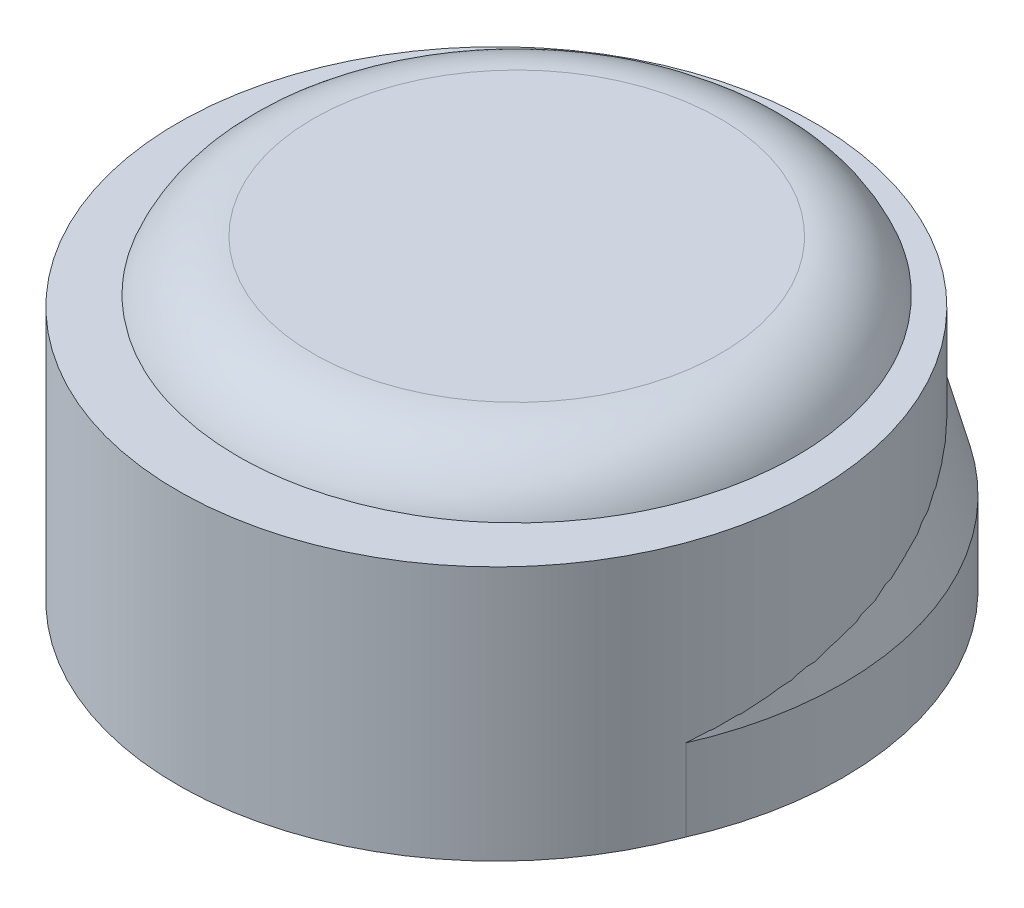
ISO-10303-21;
HEADER;
FILE_DESCRIPTION(('STEP AP214'),'2;1');
FILE_NAME('part.step','',(''),(''),'','','');
FILE_SCHEMA(('AUTOMOTIVE_DESIGN { 1 0 10303 214 1 1 1 1 }'));
ENDSEC;
DATA;
#1=APPLICATION_CONTEXT('core data for automotive mechanical design processes');
#2=APPLICATION_PROTOCOL_DEFINITION('international standard','automotive_design',2000,#1);
#3=PRODUCT_CONTEXT('',#1,'mechanical');
#4=PRODUCT('Part','Part','',(#3));
#5=PRODUCT_RELATED_PRODUCT_CATEGORY('part','',(#4));
#6=PRODUCT_DEFINITION_FORMATION('','',#4);
#7=PRODUCT_DEFINITION_CONTEXT('part definition',#1,'design');
#8=PRODUCT_DEFINITION('design','',#6,#7);
#9=PRODUCT_DEFINITION_SHAPE('','',#8);
#10=(LENGTH_UNIT() NAMED_UNIT(*) SI_UNIT(.MILLI.,.METRE.));
#11=(NAMED_UNIT(*) PLANE_ANGLE_UNIT() SI_UNIT($,.RADIAN.));
#12=(NAMED_UNIT(*) SI_UNIT($,.STERADIAN.) SOLID_ANGLE_UNIT());
#13=UNCERTAINTY_MEASURE_WITH_UNIT(LENGTH_MEASURE(1.E-05),#10,'distance_accuracy_value','');
#14=(GEOMETRIC_REPRESENTATION_CONTEXT(3) GLOBAL_UNCERTAINTY_ASSIGNED_CONTEXT((#13)) GLOBAL_UNIT_ASSIGNED_CONTEXT((#10,
#11,#12)) REPRESENTATION_CONTEXT('',''));
#15=CARTESIAN_POINT('',(0.,0.,0.));
#16=DIRECTION('',(0.,0.,1.));
#17=DIRECTION('',(1.,0.,0.));
#18=AXIS2_PLACEMENT_3D('',#15,#16,#17);
#19=CARTESIAN_POINT('',(0.,6.35,0.508));
#20=DIRECTION('',(0.,-1.,0.));
#21=DIRECTION('',(1.,0.,0.));
#22=AXIS2_PLACEMENT_3D('',#19,#20,#21);
#23=CYLINDRICAL_SURFACE('',#22,7.9375);
#24=CARTESIAN_POINT('',(0.,6.35,0.508));
#25=DIRECTION('',(0.,-1.,0.));
#26=DIRECTION('',(1.,0.,0.));
#27=AXIS2_PLACEMENT_3D('',#24,#25,#26);
#28=CIRCLE('',#27,7.9375);
#29=CARTESIAN_POINT('',(7.9375,6.35,0.508));
#30=VERTEX_POINT('',#29);
#31=EDGE_CURVE('E11',#30,#30,#28,.T.);
#32=ORIENTED_EDGE('',*,*,#31,.T.);
#33=EDGE_LOOP('',(#32));
#34=FACE_BOUND('',#33,.T.);
#35=CARTESIAN_POINT('',(0.,0.,0.508));
#36=DIRECTION('',(0.,-1.,0.));
#37=DIRECTION('',(1.,0.,0.));
#38=AXIS2_PLACEMENT_3D('',#35,#36,#37);
#39=CIRCLE('',#38,7.9375);
#40=CARTESIAN_POINT('',(7.9375,0.,0.508));
#41=VERTEX_POINT('',#40);
#42=EDGE_CURVE('E44',#41,#41,#39,.T.);
#43=ORIENTED_EDGE('',*,*,#42,.F.);
#44=EDGE_LOOP('',(#43));
#45=FACE_BOUND('',#44,.T.);
#46=ADVANCED_FACE('F41',(#34,#45),#23,.T.);
#47=CARTESIAN_POINT('',(0.,6.35,0.508));
#48=DIRECTION('',(0.,-1.,0.));
#49=DIRECTION('',(1.,0.,0.));
#50=AXIS2_PLACEMENT_3D('',#47,#48,#49);
#51=PLANE('',#50);
#52=ORIENTED_EDGE('',*,*,#31,.F.);
#53=EDGE_LOOP('',(#52));
#54=FACE_BOUND('',#53,.T.);
#55=ADVANCED_FACE('F56',(#54),#51,.F.);
#56=CARTESIAN_POINT('',(0.,0.,0.508));
#57=DIRECTION('',(0.,-1.,0.));
#58=DIRECTION('',(1.,0.,0.));
#59=AXIS2_PLACEMENT_3D('',#56,#57,#58);
#60=PLANE('',#59);
#61=ORIENTED_EDGE('',*,*,#42,.T.);
#62=EDGE_LOOP('',(#61));
#63=FACE_BOUND('',#62,.T.);
#64=ADVANCED_FACE('F53',(#63),#60,.T.);
#65=CLOSED_SHELL('',(#46,#55,#64));
#66=MANIFOLD_SOLID_BREP('B2',#65);
#67=CARTESIAN_POINT('',(-1.4732,0.,0.));
#68=DIRECTION('',(0.,-1.,0.));
#69=DIRECTION('',(1.,0.,0.));
#70=AXIS2_PLACEMENT_3D('',#67,#68,#69);
#71=PLANE('',#70);
#72=CARTESIAN_POINT('',(0.,0.,2.));
#73=DIRECTION('',(0.,-1.,0.));
#74=DIRECTION('',(1.,0.,0.));
#75=AXIS2_PLACEMENT_3D('',#72,#73,#74);
#76=CIRCLE('',#75,3.873);
#77=CARTESIAN_POINT('',(3.873,0.,2.));
#78=VERTEX_POINT('',#77);
#79=EDGE_CURVE('E102',#78,#78,#76,.T.);
#80=ORIENTED_EDGE('',*,*,#79,.F.);
#81=EDGE_LOOP('',(#80));
#82=FACE_BOUND('',#81,.T.);
#83=CARTESIAN_POINT('',(0.,0.,0.));
#84=DIRECTION('',(0.,1.,0.));
#85=DIRECTION('',(-1.,0.,0.));
#86=AXIS2_PLACEMENT_3D('',#83,#84,#85);
#87=CIRCLE('',#86,8.128);
#88=CARTESIAN_POINT('',(-8.128,0.,0.));
#89=VERTEX_POINT('',#88);
#90=EDGE_CURVE('E40',#89,#89,#87,.T.);
#91=ORIENTED_EDGE('',*,*,#90,.F.);
#92=EDGE_LOOP('',(#91));
#93=FACE_BOUND('',#92,.T.);
#94=ADVANCED_FACE('F82',(#82,#93),#71,.T.);
#95=CARTESIAN_POINT('',(0.,0.,0.));
#96=DIRECTION('',(0.,1.,0.));
#97=DIRECTION('',(-1.,0.,0.));
#98=AXIS2_PLACEMENT_3D('',#95,#96,#97);
#99=CYLINDRICAL_SURFACE('',#98,8.128);
#100=ORIENTED_EDGE('',*,*,#90,.T.);
#101=EDGE_LOOP('',(#100));
#102=FACE_BOUND('',#101,.T.);
#103=CARTESIAN_POINT('',(0.,2.032,0.));
#104=DIRECTION('',(0.,1.,0.));
#105=DIRECTION('',(-1.,0.,0.));
#106=AXIS2_PLACEMENT_3D('',#103,#104,#105);
#107=CIRCLE('',#106,8.128);
#108=CARTESIAN_POINT('',(-8.128,2.032,0.));
#109=VERTEX_POINT('',#108);
#110=EDGE_CURVE('E88',#109,#109,#107,.T.);
#111=ORIENTED_EDGE('',*,*,#110,.F.);
#112=EDGE_LOOP('',(#111));
#113=FACE_BOUND('',#112,.T.);
#114=ADVANCED_FACE('F119',(#102,#113),#99,.T.);
#115=CARTESIAN_POINT('',(0.,6.11392029964832,0.));
#116=DIRECTION('',(0.,-1.,0.));
#117=DIRECTION('',(1.,0.,0.));
#118=AXIS2_PLACEMENT_3D('',#115,#116,#117);
#119=CONICAL_SURFACE('',#118,7.03425275214102,0.26179938779915);
#120=ORIENTED_EDGE('',*,*,#110,.T.);
#121=EDGE_LOOP('',(#120));
#122=FACE_BOUND('',#121,.T.);
#123=CARTESIAN_POINT('',(0.,6.11392029964832,0.));
#124=DIRECTION('',(0.,1.,0.));
#125=DIRECTION('',(-1.,0.,0.));
#126=AXIS2_PLACEMENT_3D('',#123,#124,#125);
#127=CIRCLE('',#126,7.03425275214102);
#128=CARTESIAN_POINT('',(-7.03425275214102,6.11392029964832,0.));
#129=VERTEX_POINT('',#128);
#130=EDGE_CURVE('E92',#129,#129,#127,.T.);
#131=ORIENTED_EDGE('',*,*,#130,.F.);
#132=EDGE_LOOP('',(#131));
#133=FACE_BOUND('',#132,.T.);
#134=ADVANCED_FACE('F123',(#122,#133),#119,.T.);
#135=CARTESIAN_POINT('',(0.,5.588,0.));
#136=DIRECTION('',(0.,1.,0.));
#137=DIRECTION('',(-1.,0.,0.));
#138=AXIS2_PLACEMENT_3D('',#135,#136,#137);
#139=TOROIDAL_SURFACE('',#138,5.07149147312164,2.032);
#140=ORIENTED_EDGE('',*,*,#130,.T.);
#141=EDGE_LOOP('',(#140));
#142=FACE_BOUND('',#141,.T.);
#143=CARTESIAN_POINT('',(0.,7.62,0.));
#144=DIRECTION('',(0.,1.,0.));
#145=DIRECTION('',(-1.,0.,0.));
#146=AXIS2_PLACEMENT_3D('',#143,#144,#145);
#147=CIRCLE('',#146,5.07149147312164);
#148=CARTESIAN_POINT('',(-5.07149147312164,7.62,0.));
#149=VERTEX_POINT('',#148);
#150=EDGE_CURVE('E96',#149,#149,#147,.T.);
#151=ORIENTED_EDGE('',*,*,#150,.F.);
#152=EDGE_LOOP('',(#151));
#153=FACE_BOUND('',#152,.T.);
#154=ADVANCED_FACE('F127',(#142,#153),#139,.T.);
#155=CARTESIAN_POINT('',(-1.4732,7.62,0.));
#156=DIRECTION('',(0.,1.,0.));
#157=DIRECTION('',(-1.,0.,0.));
#158=AXIS2_PLACEMENT_3D('',#155,#156,#157);
#159=PLANE('',#158);
#160=ORIENTED_EDGE('',*,*,#150,.T.);
#161=EDGE_LOOP('',(#160));
#162=FACE_BOUND('',#161,.T.);
#163=ADVANCED_FACE('F113',(#162),#159,.T.);
#164=CARTESIAN_POINT('',(0.,-1.778,2.));
#165=DIRECTION('',(0.,1.,0.));
#166=DIRECTION('',(-1.,0.,0.));
#167=AXIS2_PLACEMENT_3D('',#164,#165,#166);
#168=CYLINDRICAL_SURFACE('',#167,3.873);
#169=CARTESIAN_POINT('',(0.,-1.778,2.));
#170=DIRECTION('',(0.,-1.,0.));
#171=DIRECTION('',(1.,0.,0.));
#172=AXIS2_PLACEMENT_3D('',#169,#170,#171);
#173=CIRCLE('',#172,3.873);
#174=CARTESIAN_POINT('',(3.873,-1.778,2.));
#175=VERTEX_POINT('',#174);
#176=EDGE_CURVE('E101',#175,#175,#173,.T.);
#177=ORIENTED_EDGE('',*,*,#176,.F.);
#178=EDGE_LOOP('',(#177));
#179=FACE_BOUND('',#178,.T.);
#180=ORIENTED_EDGE('',*,*,#79,.T.);
#181=EDGE_LOOP('',(#180));
#182=FACE_BOUND('',#181,.T.);
#183=ADVANCED_FACE('F110',(#179,#182),#168,.T.);
#184=CARTESIAN_POINT('',(0.,-1.778,2.));
#185=DIRECTION('',(0.,-1.,0.));
#186=DIRECTION('',(1.,0.,0.));
#187=AXIS2_PLACEMENT_3D('',#184,#185,#186);
#188=PLANE('',#187);
#189=ORIENTED_EDGE('',*,*,#176,.T.);
#190=EDGE_LOOP('',(#189));
#191=FACE_BOUND('',#190,.T.);
#192=ADVANCED_FACE('F108',(#191),#188,.T.);
#193=CLOSED_SHELL('',(#94,#114,#134,#154,#163,#183,#192));
#194=MANIFOLD_SOLID_BREP('B6',#193);
#195=ADVANCED_BREP_SHAPE_REPRESENTATION('',(#18,#66,#194),#14);
#196=SHAPE_DEFINITION_REPRESENTATION(#9,#195);
ENDSEC;
END-ISO-10303-21;
